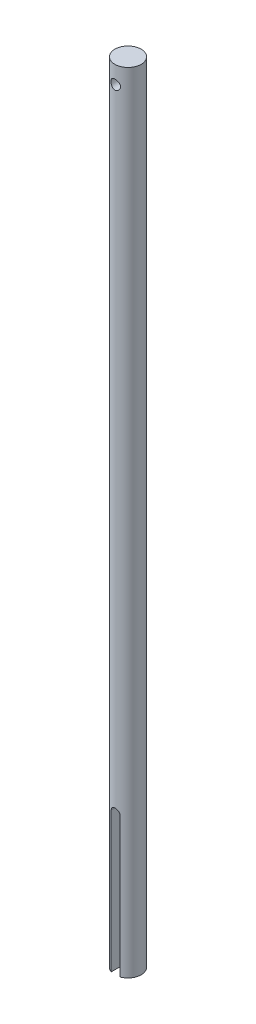
ISO-10303-21;
HEADER;
FILE_DESCRIPTION(('STEP AP214'),'2;1');
FILE_NAME('part.step','',(''),(''),'','','');
FILE_SCHEMA(('AUTOMOTIVE_DESIGN { 1 0 10303 214 1 1 1 1 }'));
ENDSEC;
DATA;
#1=APPLICATION_CONTEXT('core data for automotive mechanical design processes');
#2=APPLICATION_PROTOCOL_DEFINITION('international standard','automotive_design',2000,#1);
#3=PRODUCT_CONTEXT('',#1,'mechanical');
#4=PRODUCT('Part','Part','',(#3));
#5=PRODUCT_RELATED_PRODUCT_CATEGORY('part','',(#4));
#6=PRODUCT_DEFINITION_FORMATION('','',#4);
#7=PRODUCT_DEFINITION_CONTEXT('part definition',#1,'design');
#8=PRODUCT_DEFINITION('design','',#6,#7);
#9=PRODUCT_DEFINITION_SHAPE('','',#8);
#10=(LENGTH_UNIT() NAMED_UNIT(*) SI_UNIT(.MILLI.,.METRE.));
#11=(NAMED_UNIT(*) PLANE_ANGLE_UNIT() SI_UNIT($,.RADIAN.));
#12=(NAMED_UNIT(*) SI_UNIT($,.STERADIAN.) SOLID_ANGLE_UNIT());
#13=UNCERTAINTY_MEASURE_WITH_UNIT(LENGTH_MEASURE(1.E-05),#10,'distance_accuracy_value','');
#14=(GEOMETRIC_REPRESENTATION_CONTEXT(3) GLOBAL_UNCERTAINTY_ASSIGNED_CONTEXT((#13)) GLOBAL_UNIT_ASSIGNED_CONTEXT((#10,
#11,#12)) REPRESENTATION_CONTEXT('',''));
#15=CARTESIAN_POINT('',(0.,0.,0.));
#16=DIRECTION('',(0.,0.,1.));
#17=DIRECTION('',(1.,0.,0.));
#18=AXIS2_PLACEMENT_3D('',#15,#16,#17);
#19=CARTESIAN_POINT('',(0.,0.,0.));
#20=DIRECTION('',(0.,1.,0.));
#21=DIRECTION('',(0.,0.,1.));
#22=AXIS2_PLACEMENT_3D('',#19,#20,#21);
#23=PLANE('',#22);
#24=CARTESIAN_POINT('',(0.,0.,0.));
#25=DIRECTION('',(0.,1.,0.));
#26=DIRECTION('',(0.,0.,1.));
#27=AXIS2_PLACEMENT_3D('',#24,#25,#26);
#28=CIRCLE('',#27,4.7625);
#29=CARTESIAN_POINT('',(-1.58749999999999,0.,-4.49012806053458));
#30=VERTEX_POINT('',#29);
#31=CARTESIAN_POINT('',(-1.58749999999999,0.,4.49012806053458));
#32=VERTEX_POINT('',#31);
#33=EDGE_CURVE('E107',#30,#32,#28,.T.);
#34=ORIENTED_EDGE('',*,*,#33,.F.);
#35=DIRECTION('',(0.,0.,1.));
#36=VECTOR('',#35,1.);
#37=CARTESIAN_POINT('',(-1.58749999999999,0.,0.));
#38=LINE('',#37,#36);
#39=EDGE_CURVE('E114',#30,#32,#38,.T.);
#40=ORIENTED_EDGE('',*,*,#39,.T.);
#41=EDGE_LOOP('',(#34,#40));
#42=FACE_BOUND('',#41,.T.);
#43=ADVANCED_FACE('F35',(#42),#23,.F.);
#44=CARTESIAN_POINT('',(0.,285.75,0.));
#45=DIRECTION('',(0.,-1.,0.));
#46=DIRECTION('',(0.,0.,-1.));
#47=AXIS2_PLACEMENT_3D('',#44,#45,#46);
#48=CYLINDRICAL_SURFACE('',#47,4.7625);
#49=CARTESIAN_POINT('',(0.,281.1272,-4.7625));
#50=CARTESIAN_POINT('',(-0.0937545755041885,281.127202355901,-4.76250171834447));
#51=CARTESIAN_POINT('',(-0.187492537746567,281.119542129238,-4.75970697405948));
#52=CARTESIAN_POINT('',(-0.372179051588622,281.089218213223,-4.74883616948695));
#53=CARTESIAN_POINT('',(-0.463127800957485,281.066555590202,-4.7407604845552));
#54=CARTESIAN_POINT('',(-0.639546381771836,281.007125673839,-4.7201979571911));
#55=CARTESIAN_POINT('',(-0.725026017466991,280.970384495207,-4.7077192853569));
#56=CARTESIAN_POINT('',(-0.88860522192782,280.883968723704,-4.67960297548279));
#57=CARTESIAN_POINT('',(-0.966702948193986,280.834290913451,-4.6639645518196));
#58=CARTESIAN_POINT('',(-1.11643400456062,280.721327149813,-4.63045168616153));
#59=CARTESIAN_POINT('',(-1.18773147100918,280.657614086317,-4.61251683817496));
#60=CARTESIAN_POINT('',(-1.31889594298571,280.519295329149,-4.57674015098026));
#61=CARTESIAN_POINT('',(-1.3787597706873,280.444686617315,-4.55889833896658));
#62=CARTESIAN_POINT('',(-1.48742500324077,280.283492618156,-4.52463700135301));
#63=CARTESIAN_POINT('',(-1.53576368249298,280.196578570947,-4.5082894987665));
#64=CARTESIAN_POINT('',(-1.61698961938085,280.015167151298,-4.47980104480066));
#65=CARTESIAN_POINT('',(-1.64988259520988,279.920672600448,-4.46765853711715));
#66=CARTESIAN_POINT('',(-1.69797749038511,279.730636633904,-4.44959767382086));
#67=CARTESIAN_POINT('',(-1.71381711651929,279.635278542342,-4.44345581754789));
#68=CARTESIAN_POINT('',(-1.72934980765037,279.443075365701,-4.4374352710222));
#69=CARTESIAN_POINT('',(-1.72904899898391,279.346230858767,-4.43755420439544));
#70=CARTESIAN_POINT('',(-1.71279924732252,279.159511344778,-4.44384811377055));
#71=CARTESIAN_POINT('',(-1.69771806001629,279.069547440929,-4.44968724869642));
#72=CARTESIAN_POINT('',(-1.65376436768735,278.893526697569,-4.46620813858151));
#73=CARTESIAN_POINT('',(-1.62488992090507,278.807470410024,-4.4768905753505));
#74=CARTESIAN_POINT('',(-1.55366551460966,278.63987756879,-4.50210772591772));
#75=CARTESIAN_POINT('',(-1.51108084761873,278.558451175084,-4.51670873881532));
#76=CARTESIAN_POINT('',(-1.41380812045639,278.403641349493,-4.54809404564589));
#77=CARTESIAN_POINT('',(-1.35911607826873,278.330260575648,-4.56487905712761));
#78=CARTESIAN_POINT('',(-1.23515054513019,278.188798335844,-4.60002246491734));
#79=CARTESIAN_POINT('',(-1.16517908451574,278.121335224825,-4.61841361301414));
#80=CARTESIAN_POINT('',(-1.01469862225518,277.998923641465,-4.65378991051253));
#81=CARTESIAN_POINT('',(-0.934188206237402,277.943976851583,-4.6707748706975));
#82=CARTESIAN_POINT('',(-0.763420245819729,277.847534071726,-4.70172488258923));
#83=CARTESIAN_POINT('',(-0.673044833285321,277.806231568085,-4.71564563055728));
#84=CARTESIAN_POINT('',(-0.48599928401269,277.739617835782,-4.73857256830597));
#85=CARTESIAN_POINT('',(-0.389331773096026,277.714299982999,-4.74758079364978));
#86=CARTESIAN_POINT('',(-0.197659749704722,277.681534161322,-4.75931617922052));
#87=CARTESIAN_POINT('',(-0.102815493160612,277.673252673865,-4.76233603636104));
#88=CARTESIAN_POINT('',(0.0869438724046454,277.672383788029,-4.76265074022797));
#89=CARTESIAN_POINT('',(0.181858962924007,277.679793173969,-4.75994675999552));
#90=CARTESIAN_POINT('',(0.365545840083653,277.709453508677,-4.74931100003495));
#91=CARTESIAN_POINT('',(0.454416128347589,277.731169052846,-4.74156792972121));
#92=CARTESIAN_POINT('',(0.627198052222043,277.788131307548,-4.72182130283949));
#93=CARTESIAN_POINT('',(0.711109041367521,277.823379777685,-4.70981719224998));
#94=CARTESIAN_POINT('',(0.874274930435845,277.9075089794,-4.68231719842578));
#95=CARTESIAN_POINT('',(0.95332805701118,277.956750729093,-4.66673127727809));
#96=CARTESIAN_POINT('',(1.10230592632144,278.067056141677,-4.63380601545739));
#97=CARTESIAN_POINT('',(1.17222744690549,278.128123958708,-4.61646605967034));
#98=CARTESIAN_POINT('',(1.30491394288274,278.264247587931,-4.58078402533573));
#99=CARTESIAN_POINT('',(1.36708593931879,278.339881999128,-4.5624385518248));
#100=CARTESIAN_POINT('',(1.47795904800677,278.500883869895,-4.52773988544859));
#101=CARTESIAN_POINT('',(1.52665934582227,278.586251917474,-4.51138681306805));
#102=CARTESIAN_POINT('',(1.60915598482924,278.764768583548,-4.48262715523981));
#103=CARTESIAN_POINT('',(1.64292313672782,278.857932020626,-4.47022831205347));
#104=CARTESIAN_POINT('',(1.69408926902747,279.049191964841,-4.4510929570739));
#105=CARTESIAN_POINT('',(1.71149749451732,279.147285652631,-4.44435324730583));
#106=CARTESIAN_POINT('',(1.72865526381664,279.339243723648,-4.4377059010901));
#107=CARTESIAN_POINT('',(1.72940752835192,279.433005869573,-4.43741033254274));
#108=CARTESIAN_POINT('',(1.71577013964867,279.619244395488,-4.4427009187927));
#109=CARTESIAN_POINT('',(1.70138173895319,279.711720881194,-4.44828658705249));
#110=CARTESIAN_POINT('',(1.65863204862724,279.890271962107,-4.46439725812017));
#111=CARTESIAN_POINT('',(1.63065377546419,279.976451530709,-4.47478651136457));
#112=CARTESIAN_POINT('',(1.56184677525983,280.142949695612,-4.49926303354308));
#113=CARTESIAN_POINT('',(1.52101490553977,280.223266852644,-4.51335120671582));
#114=CARTESIAN_POINT('',(1.42529173471966,280.380112352823,-4.54451319020949));
#115=CARTESIAN_POINT('',(1.36980066722248,280.456251794312,-4.56170088396454));
#116=CARTESIAN_POINT('',(1.2472883429977,280.598459822631,-4.59670891849955));
#117=CARTESIAN_POINT('',(1.18026354487465,280.664525304499,-4.6145294522533));
#118=CARTESIAN_POINT('',(1.03263324037727,280.788018397014,-4.64984991483973));
#119=CARTESIAN_POINT('',(0.951521301887577,280.844860009911,-4.66729078291507));
#120=CARTESIAN_POINT('',(0.780291521443958,280.944070184188,-4.69894908939758));
#121=CARTESIAN_POINT('',(0.690173949614117,280.986439179507,-4.71316662444688));
#122=CARTESIAN_POINT('',(0.501900679624105,281.055757574612,-4.73694368902278));
#123=CARTESIAN_POINT('',(0.403639098126046,281.082448295233,-4.7464247096542));
#124=CARTESIAN_POINT('',(0.203577477173889,281.118164502359,-4.75920062737302));
#125=CARTESIAN_POINT('',(0.101778949190978,281.127197442459,-4.7624981345839));
#126=CARTESIAN_POINT('',(0.,281.1272,-4.7625));
#127=B_SPLINE_CURVE_WITH_KNOTS('',3,(#49,#50,#51,#52,#53,#54,#55,#56,#57,#58,#59,#60,#61,#62,
#63,#64,#65,#66,#67,#68,#69,#70,#71,#72,#73,#74,#75,#76,#77,#78,#79,#80,#81,#82,#83,#84,#85,#86,
#87,#88,#89,#90,#91,#92,#93,#94,#95,#96,#97,#98,#99,#100,#101,#102,#103,#104,#105,#106,#107,
#108,#109,#110,#111,#112,#113,#114,#115,#116,#117,#118,#119,#120,#121,#122,#123,#124,#125,#126),
.UNSPECIFIED.,.T.,.F.,(4,2,2,2,2,2,2,2,2,2,2,2,2,2,2,2,2,2,2,2,2,2,2,2,2,2,2,2,2,2,2,2,2,2,2,2,
2,2,4),(0.,0.280888568560694,0.561757174448096,0.842107291718059,1.12252719966264,
1.41308696989153,1.70372738016214,2.00458224645653,2.30532564451792,2.59438406168858,
2.88333276331156,3.15627507377103,3.42925581927924,3.70718323201373,3.98520218895517,
4.28060702184993,4.57605154002559,4.87552186191706,5.1748680001882,5.459182033083,
5.74343780440507,6.01761745219632,6.29183276195998,6.57388985710037,6.85604621068671,
7.15348950144263,7.45095077031253,7.74899093368199,8.04686256106611,8.32674955230255,
8.6066133911253,8.87901088412521,9.15147502956571,9.43753165766332,9.72367627577635,
10.0239198759341,10.3241544729829,10.6292128503899,10.9341424305637),.UNSPECIFIED.);
#128=CARTESIAN_POINT('',(0.,281.1272,-4.7625));
#129=VERTEX_POINT('',#128);
#130=EDGE_CURVE('E11',#129,#129,#127,.T.);
#131=ORIENTED_EDGE('',*,*,#130,.T.);
#132=EDGE_LOOP('',(#131));
#133=FACE_BOUND('',#132,.T.);
#134=CARTESIAN_POINT('',(0.,277.6728,4.7625));
#135=CARTESIAN_POINT('',(-0.0937545755041915,277.672797644099,4.76250171834447));
#136=CARTESIAN_POINT('',(-0.187492537746573,277.680457870762,4.75970697405948));
#137=CARTESIAN_POINT('',(-0.372179051588628,277.710781786777,4.74883616948695));
#138=CARTESIAN_POINT('',(-0.463127800957488,277.733444409798,4.7407604845552));
#139=CARTESIAN_POINT('',(-0.639546381771836,277.792874326161,4.7201979571911));
#140=CARTESIAN_POINT('',(-0.725026017466991,277.829615504793,4.7077192853569));
#141=CARTESIAN_POINT('',(-0.88860522192782,277.916031276296,4.67960297548279));
#142=CARTESIAN_POINT('',(-0.966702948193986,277.965709086549,4.6639645518196));
#143=CARTESIAN_POINT('',(-1.11643400456062,278.078672850187,4.63045168616153));
#144=CARTESIAN_POINT('',(-1.18773147100918,278.142385913683,4.61251683817496));
#145=CARTESIAN_POINT('',(-1.31889594298571,278.280704670851,4.57674015098026));
#146=CARTESIAN_POINT('',(-1.3787597706873,278.355313382684,4.55889833896658));
#147=CARTESIAN_POINT('',(-1.48742500324077,278.516507381844,4.52463700135301));
#148=CARTESIAN_POINT('',(-1.53576368249298,278.603421429053,4.5082894987665));
#149=CARTESIAN_POINT('',(-1.61698961938085,278.784832848702,4.47980104480066));
#150=CARTESIAN_POINT('',(-1.64988259520988,278.879327399552,4.46765853711715));
#151=CARTESIAN_POINT('',(-1.69797749038511,279.069363366096,4.44959767382086));
#152=CARTESIAN_POINT('',(-1.71381711651929,279.164721457658,4.44345581754789));
#153=CARTESIAN_POINT('',(-1.72934980765037,279.356924634299,4.4374352710222));
#154=CARTESIAN_POINT('',(-1.72904899898391,279.453769141233,4.43755420439544));
#155=CARTESIAN_POINT('',(-1.71279924732252,279.640488655222,4.44384811377055));
#156=CARTESIAN_POINT('',(-1.69771806001629,279.730452559071,4.44968724869642));
#157=CARTESIAN_POINT('',(-1.65376436768735,279.906473302431,4.46620813858151));
#158=CARTESIAN_POINT('',(-1.62488992090508,279.992529589976,4.4768905753505));
#159=CARTESIAN_POINT('',(-1.55366551460966,280.16012243121,4.50210772591772));
#160=CARTESIAN_POINT('',(-1.5110808476187,280.241548824916,4.51670873881533));
#161=CARTESIAN_POINT('',(-1.41380812045637,280.396358650507,4.5480940456459));
#162=CARTESIAN_POINT('',(-1.35911607826873,280.469739424352,4.56487905712761));
#163=CARTESIAN_POINT('',(-1.2351505451302,280.611201664156,4.60002246491734));
#164=CARTESIAN_POINT('',(-1.16517908451574,280.678664775175,4.61841361301414));
#165=CARTESIAN_POINT('',(-1.01469862225518,280.801076358535,4.65378991051253));
#166=CARTESIAN_POINT('',(-0.934188206237402,280.856023148417,4.6707748706975));
#167=CARTESIAN_POINT('',(-0.76342024581973,280.952465928274,4.70172488258923));
#168=CARTESIAN_POINT('',(-0.673044833285321,280.993768431915,4.71564563055728));
#169=CARTESIAN_POINT('',(-0.48599928401269,281.060382164218,4.73857256830597));
#170=CARTESIAN_POINT('',(-0.389331773096026,281.085700017001,4.74758079364978));
#171=CARTESIAN_POINT('',(-0.197659749704722,281.118465838678,4.75931617922052));
#172=CARTESIAN_POINT('',(-0.102815493160612,281.126747326135,4.76233603636104));
#173=CARTESIAN_POINT('',(0.0869438724046453,281.127616211971,4.76265074022797));
#174=CARTESIAN_POINT('',(0.181858962924007,281.120206826031,4.75994675999552));
#175=CARTESIAN_POINT('',(0.365545840083653,281.090546491323,4.74931100003495));
#176=CARTESIAN_POINT('',(0.45441612834759,281.068830947154,4.74156792972121));
#177=CARTESIAN_POINT('',(0.627198052222043,281.011868692452,4.72182130283949));
#178=CARTESIAN_POINT('',(0.711109041367519,280.976620222315,4.70981719224998));
#179=CARTESIAN_POINT('',(0.874274930435854,280.8924910206,4.68231719842578));
#180=CARTESIAN_POINT('',(0.9533280570112,280.843249270907,4.66673127727808));
#181=CARTESIAN_POINT('',(1.10230592632146,280.732943858323,4.63380601545739));
#182=CARTESIAN_POINT('',(1.17222744690549,280.671876041292,4.61646605967034));
#183=CARTESIAN_POINT('',(1.30491394288273,280.535752412069,4.58078402533573));
#184=CARTESIAN_POINT('',(1.36708593931879,280.460118000872,4.5624385518248));
#185=CARTESIAN_POINT('',(1.47795904800677,280.299116130105,4.52773988544859));
#186=CARTESIAN_POINT('',(1.52665934582227,280.213748082526,4.51138681306805));
#187=CARTESIAN_POINT('',(1.60915598482924,280.035231416451,4.48262715523981));
#188=CARTESIAN_POINT('',(1.64292313672782,279.942067979374,4.47022831205347));
#189=CARTESIAN_POINT('',(1.69408926902747,279.750808035159,4.4510929570739));
#190=CARTESIAN_POINT('',(1.71149749451732,279.652714347369,4.44435324730583));
#191=CARTESIAN_POINT('',(1.72865526381664,279.460756276352,4.4377059010901));
#192=CARTESIAN_POINT('',(1.72940752835192,279.366994130427,4.43741033254274));
#193=CARTESIAN_POINT('',(1.71577013964868,279.180755604512,4.4427009187927));
#194=CARTESIAN_POINT('',(1.7013817389532,279.088279118806,4.44828658705248));
#195=CARTESIAN_POINT('',(1.65863204862724,278.909728037893,4.46439725812017));
#196=CARTESIAN_POINT('',(1.63065377546417,278.823548469291,4.47478651136457));
#197=CARTESIAN_POINT('',(1.56184677525981,278.657050304388,4.49926303354309));
#198=CARTESIAN_POINT('',(1.52101490553977,278.576733147356,4.51335120671582));
#199=CARTESIAN_POINT('',(1.42529173471966,278.419887647177,4.54451319020949));
#200=CARTESIAN_POINT('',(1.36980066722249,278.343748205688,4.56170088396454));
#201=CARTESIAN_POINT('',(1.2472883429977,278.201540177369,4.59670891849955));
#202=CARTESIAN_POINT('',(1.18026354487465,278.135474695501,4.6145294522533));
#203=CARTESIAN_POINT('',(1.03263324037727,278.011981602985,4.64984991483973));
#204=CARTESIAN_POINT('',(0.951521301887578,277.955139990089,4.66729078291507));
#205=CARTESIAN_POINT('',(0.780291521443957,277.855929815812,4.69894908939758));
#206=CARTESIAN_POINT('',(0.690173949614117,277.813560820493,4.71316662444688));
#207=CARTESIAN_POINT('',(0.501900679624105,277.744242425388,4.73694368902278));
#208=CARTESIAN_POINT('',(0.403639098126046,277.717551704767,4.7464247096542));
#209=CARTESIAN_POINT('',(0.203577477173889,277.681835497641,4.75920062737302));
#210=CARTESIAN_POINT('',(0.101778949190978,277.672802557541,4.7624981345839));
#211=CARTESIAN_POINT('',(0.,277.6728,4.7625));
#212=B_SPLINE_CURVE_WITH_KNOTS('',3,(#134,#135,#136,#137,#138,#139,#140,#141,#142,#143,#144,
#145,#146,#147,#148,#149,#150,#151,#152,#153,#154,#155,#156,#157,#158,#159,#160,#161,#162,#163,
#164,#165,#166,#167,#168,#169,#170,#171,#172,#173,#174,#175,#176,#177,#178,#179,#180,#181,#182,
#183,#184,#185,#186,#187,#188,#189,#190,#191,#192,#193,#194,#195,#196,#197,#198,#199,#200,#201,
#202,#203,#204,#205,#206,#207,#208,#209,#210,#211),.UNSPECIFIED.,.T.,.F.,(4,2,2,2,2,2,2,2,2,2,2,
2,2,2,2,2,2,2,2,2,2,2,2,2,2,2,2,2,2,2,2,2,2,2,2,2,2,2,4),(0.,0.280888568560703,
0.561757174448097,0.842107291718059,1.12252719966264,1.41308696989153,1.70372738016214,
2.00458224645653,2.30532564451792,2.59438406168858,2.88333276331156,3.15627507377103,
3.42925581927924,3.70718323201374,3.98520218895516,4.28060702184992,4.57605154002559,
4.87552186191705,5.1748680001882,5.459182033083,5.74343780440507,6.01761745219632,
6.29183276195997,6.57388985710038,6.8560462106867,7.15348950144263,7.45095077031253,
7.74899093368199,8.04686256106611,8.32674955230255,8.6066133911253,8.87901088412521,
9.1514750295657,9.43753165766331,9.72367627577635,10.0239198759341,10.3241544729828,
10.6292128503899,10.9341424305637),.UNSPECIFIED.);
#213=CARTESIAN_POINT('',(0.,277.6728,4.7625));
#214=VERTEX_POINT('',#213);
#215=EDGE_CURVE('E47',#214,#214,#212,.T.);
#216=ORIENTED_EDGE('',*,*,#215,.T.);
#217=EDGE_LOOP('',(#216));
#218=FACE_BOUND('',#217,.T.);
#219=CARTESIAN_POINT('',(0.,285.75,0.));
#220=DIRECTION('',(0.,1.,0.));
#221=DIRECTION('',(0.,0.,1.));
#222=AXIS2_PLACEMENT_3D('',#219,#220,#221);
#223=CIRCLE('',#222,4.7625);
#224=CARTESIAN_POINT('',(0.,285.75,4.7625));
#225=VERTEX_POINT('',#224);
#226=EDGE_CURVE('E108',#225,#225,#223,.T.);
#227=ORIENTED_EDGE('',*,*,#226,.F.);
#228=EDGE_LOOP('',(#227));
#229=FACE_BOUND('',#228,.T.);
#230=ORIENTED_EDGE('',*,*,#33,.T.);
#231=DIRECTION('',(0.,-1.,0.));
#232=VECTOR('',#231,1.);
#233=CARTESIAN_POINT('',(-1.58750000000003,285.75,4.49012806053457));
#234=LINE('',#233,#232);
#235=CARTESIAN_POINT('',(-1.5875,50.8,4.49012806053458));
#236=VERTEX_POINT('',#235);
#237=EDGE_CURVE('E62',#32,#236,#234,.F.);
#238=ORIENTED_EDGE('',*,*,#237,.T.);
#239=CARTESIAN_POINT('',(-1.58750000000002,50.8,4.49012806053457));
#240=CARTESIAN_POINT('',(-1.58750118659149,50.8433236636718,4.49012376824762));
#241=CARTESIAN_POINT('',(-1.5857253727825,50.8866252112256,4.49075587659901));
#242=CARTESIAN_POINT('',(-1.5786506511703,50.9728923771872,4.49324932071638));
#243=CARTESIAN_POINT('',(-1.57335269440074,51.0158580831098,4.49511032466043));
#244=CARTESIAN_POINT('',(-1.55227444692889,51.1435225273223,4.50245308906633));
#245=CARTESIAN_POINT('',(-1.53130921993215,51.2273245934544,4.5096952684298));
#246=CARTESIAN_POINT('',(-1.47630897878082,51.3899549930045,4.52799568584438));
#247=CARTESIAN_POINT('',(-1.44228117688023,51.4687860431608,4.53905181775275));
#248=CARTESIAN_POINT('',(-1.36219125098175,51.6196894864837,4.56372574710893));
#249=CARTESIAN_POINT('',(-1.31612173723111,51.6917576923944,4.57734511612121));
#250=CARTESIAN_POINT('',(-1.2113440872178,51.8298433672277,4.6062023763825));
#251=CARTESIAN_POINT('',(-1.15224715626125,51.8955573727344,4.6214804345719));
#252=CARTESIAN_POINT('',(-1.02391915324899,52.0163520532443,4.65159484800102));
#253=CARTESIAN_POINT('',(-0.954686280480342,52.0714308347938,4.66643112419066));
#254=CARTESIAN_POINT('',(-0.805820787955586,52.1707737361017,4.69445789253335));
#255=CARTESIAN_POINT('',(-0.72596389185663,52.2147180627386,4.70759532129443));
#256=CARTESIAN_POINT('',(-0.559481434320818,52.2884276995535,4.73026753659895));
#257=CARTESIAN_POINT('',(-0.47285795000457,52.3181973411399,4.73980342349379));
#258=CARTESIAN_POINT('',(-0.298496585946398,52.3616804651701,4.7539127543939));
#259=CARTESIAN_POINT('',(-0.210902287205443,52.375916445179,4.7586472801936));
#260=CARTESIAN_POINT('',(-0.0344471140108966,52.3895896239094,4.76319228341059));
#261=CARTESIAN_POINT('',(0.0544134536020447,52.3890303488407,4.76300393411567));
#262=CARTESIAN_POINT('',(0.227177354381018,52.3734597005682,4.75783336333485));
#263=CARTESIAN_POINT('',(0.311138415418021,52.3590160622394,4.75303946823631));
#264=CARTESIAN_POINT('',(0.475367452197924,52.3170257971048,4.73943299795058));
#265=CARTESIAN_POINT('',(0.55563522289112,52.2894784437476,4.73062019993148));
#266=CARTESIAN_POINT('',(0.711442289061635,52.221731075759,4.70972623380696));
#267=CARTESIAN_POINT('',(0.786905502725692,52.1813694033683,4.69760360068322));
#268=CARTESIAN_POINT('',(0.930155285192242,52.0892723271673,4.6713519044207));
#269=CARTESIAN_POINT('',(0.997939758172043,52.0375338294637,4.6572222958618));
#270=CARTESIAN_POINT('',(1.12727952679153,51.92129720813,4.62766206709099));
#271=CARTESIAN_POINT('',(1.18839235843514,51.8563136995196,4.61220151154364));
#272=CARTESIAN_POINT('',(1.29900683940234,51.7168741350756,4.58227891125652));
#273=CARTESIAN_POINT('',(1.34850473755428,51.6424150309349,4.56781719016259));
#274=CARTESIAN_POINT('',(1.43510527937853,51.4847202168642,4.54136174809905));
#275=CARTESIAN_POINT('',(1.47201415259343,51.401371170044,4.52940761230323));
#276=CARTESIAN_POINT('',(1.531080616238,51.229185423076,4.50978741585988));
#277=CARTESIAN_POINT('',(1.55326149223786,51.1403576292717,4.50211458936777));
#278=CARTESIAN_POINT('',(1.57425732309579,51.0088854141626,4.49479260575369));
#279=CARTESIAN_POINT('',(1.57922128474248,50.9672567936064,4.49304834965181));
#280=CARTESIAN_POINT('',(1.585840453013,50.8837595505403,4.49071529419597));
#281=CARTESIAN_POINT('',(1.58749992918951,50.8418913079108,4.49012500388127));
#282=CARTESIAN_POINT('',(1.58749999999998,50.8,4.49012806053458));
#283=B_SPLINE_CURVE_WITH_KNOTS('',3,(#239,#240,#241,#242,#243,#244,#245,#246,#247,#248,#249,
#250,#251,#252,#253,#254,#255,#256,#257,#258,#259,#260,#261,#262,#263,#264,#265,#266,#267,#268,
#269,#270,#271,#272,#273,#274,#275,#276,#277,#278,#279,#280,#281,#282),.UNSPECIFIED.,.F.,.F.,(4,
2,2,2,2,2,2,2,2,2,2,2,2,2,2,2,2,2,2,2,2,4),(0.,0.129886844517501,0.259738631794015,
0.518447652452653,0.777014036783905,1.03573947210231,1.30359951628251,1.57150720533699,
1.84640748531298,2.1212237090479,2.38648034779752,2.65167376748644,2.90646514314354,
3.16127064766843,3.41942767386223,3.6776549920967,3.94801810817154,4.21846842120672,
4.49291122510763,4.76691908385357,4.89267333840742,5.01826500677377),.UNSPECIFIED.);
#284=CARTESIAN_POINT('',(1.58749999999998,50.8,4.49012806053458));
#285=VERTEX_POINT('',#284);
#286=EDGE_CURVE('E90',#236,#285,#283,.T.);
#287=ORIENTED_EDGE('',*,*,#286,.T.);
#288=DIRECTION('',(0.,-1.,0.));
#289=VECTOR('',#288,1.);
#290=CARTESIAN_POINT('',(1.58749999999997,285.75,4.49012806053459));
#291=LINE('',#290,#289);
#292=CARTESIAN_POINT('',(1.5875,0.,4.49012806053458));
#293=VERTEX_POINT('',#292);
#294=EDGE_CURVE('E94',#285,#293,#291,.T.);
#295=ORIENTED_EDGE('',*,*,#294,.T.);
#296=CARTESIAN_POINT('',(1.5875,0.,-4.49012806053458));
#297=VERTEX_POINT('',#296);
#298=EDGE_CURVE('E99',#293,#297,#28,.T.);
#299=ORIENTED_EDGE('',*,*,#298,.T.);
#300=DIRECTION('',(0.,-1.,0.));
#301=VECTOR('',#300,1.);
#302=CARTESIAN_POINT('',(1.58749999999997,285.75,-4.49012806053459));
#303=LINE('',#302,#301);
#304=CARTESIAN_POINT('',(1.58749999999998,50.8,-4.49012806053459));
#305=VERTEX_POINT('',#304);
#306=EDGE_CURVE('E54',#297,#305,#303,.F.);
#307=ORIENTED_EDGE('',*,*,#306,.T.);
#308=CARTESIAN_POINT('',(1.58749999999998,50.8,-4.49012806053459));
#309=CARTESIAN_POINT('',(1.58750118659146,50.8433236636718,-4.49012376824764));
#310=CARTESIAN_POINT('',(1.58572537278246,50.8866252112256,-4.49075587659902));
#311=CARTESIAN_POINT('',(1.57865065117027,50.9728923771872,-4.49324932071639));
#312=CARTESIAN_POINT('',(1.5733526944007,51.0158580831098,-4.49511032466044));
#313=CARTESIAN_POINT('',(1.55227444692886,51.1435225273223,-4.50245308906634));
#314=CARTESIAN_POINT('',(1.53130921993211,51.2273245934544,-4.50969526842981));
#315=CARTESIAN_POINT('',(1.47630897878078,51.3899549930045,-4.52799568584439));
#316=CARTESIAN_POINT('',(1.44228117688019,51.4687860431608,-4.53905181775276));
#317=CARTESIAN_POINT('',(1.36219125098171,51.6196894864837,-4.56372574710894));
#318=CARTESIAN_POINT('',(1.31612173723107,51.6917576923944,-4.57734511612122));
#319=CARTESIAN_POINT('',(1.21134408721776,51.8298433672277,-4.60620237638251));
#320=CARTESIAN_POINT('',(1.15224715626121,51.8955573727344,-4.62148043457191));
#321=CARTESIAN_POINT('',(1.02391915324896,52.0163520532443,-4.65159484800103));
#322=CARTESIAN_POINT('',(0.954686280480305,52.0714308347938,-4.66643112419067));
#323=CARTESIAN_POINT('',(0.805820787955548,52.1707737361017,-4.69445789253336));
#324=CARTESIAN_POINT('',(0.725963891856592,52.2147180627386,-4.70759532129443));
#325=CARTESIAN_POINT('',(0.559481434320779,52.2884276995535,-4.73026753659895));
#326=CARTESIAN_POINT('',(0.472857950004531,52.3181973411399,-4.73980342349379));
#327=CARTESIAN_POINT('',(0.29849658594636,52.3616804651701,-4.7539127543939));
#328=CARTESIAN_POINT('',(0.210902287205405,52.375916445179,-4.7586472801936));
#329=CARTESIAN_POINT('',(0.0344471140108587,52.3895896239094,-4.76319228341059));
#330=CARTESIAN_POINT('',(-0.0544134536020825,52.3890303488407,-4.76300393411567));
#331=CARTESIAN_POINT('',(-0.227177354381056,52.3734597005682,-4.75783336333484));
#332=CARTESIAN_POINT('',(-0.311138415418059,52.3590160622394,-4.75303946823631));
#333=CARTESIAN_POINT('',(-0.475367452197961,52.3170257971048,-4.73943299795057));
#334=CARTESIAN_POINT('',(-0.555635222891157,52.2894784437476,-4.73062019993148));
#335=CARTESIAN_POINT('',(-0.711442289061671,52.221731075759,-4.70972623380695));
#336=CARTESIAN_POINT('',(-0.786905502725729,52.1813694033683,-4.69760360068321));
#337=CARTESIAN_POINT('',(-0.930155285192278,52.0892723271673,-4.6713519044207));
#338=CARTESIAN_POINT('',(-0.997939758172079,52.0375338294637,-4.65722229586179));
#339=CARTESIAN_POINT('',(-1.12727952679157,51.92129720813,-4.62766206709099));
#340=CARTESIAN_POINT('',(-1.18839235843517,51.8563136995196,-4.61220151154363));
#341=CARTESIAN_POINT('',(-1.29900683940237,51.7168741350756,-4.58227891125651));
#342=CARTESIAN_POINT('',(-1.34850473755432,51.6424150309349,-4.56781719016258));
#343=CARTESIAN_POINT('',(-1.43510527937856,51.4847202168642,-4.54136174809904));
#344=CARTESIAN_POINT('',(-1.47201415259347,51.401371170044,-4.52940761230322));
#345=CARTESIAN_POINT('',(-1.53108061623804,51.2291854230759,-4.50978741585986));
#346=CARTESIAN_POINT('',(-1.5532614922379,51.1403576292717,-4.50211458936775));
#347=CARTESIAN_POINT('',(-1.57425732309583,51.0088854141626,-4.49479260575367));
#348=CARTESIAN_POINT('',(-1.57922128474251,50.9672567936064,-4.4930483496518));
#349=CARTESIAN_POINT('',(-1.58584045301304,50.8837595505403,-4.49071529419595));
#350=CARTESIAN_POINT('',(-1.58749992918954,50.8418913079108,-4.49012500388125));
#351=CARTESIAN_POINT('',(-1.58750000000002,50.8,-4.49012806053457));
#352=B_SPLINE_CURVE_WITH_KNOTS('',3,(#308,#309,#310,#311,#312,#313,#314,#315,#316,#317,#318,
#319,#320,#321,#322,#323,#324,#325,#326,#327,#328,#329,#330,#331,#332,#333,#334,#335,#336,#337,
#338,#339,#340,#341,#342,#343,#344,#345,#346,#347,#348,#349,#350,#351),.UNSPECIFIED.,.F.,.F.,(4,
2,2,2,2,2,2,2,2,2,2,2,2,2,2,2,2,2,2,2,2,4),(0.,0.129886844517501,0.259738631794015,
0.518447652452653,0.777014036783904,1.03573947210231,1.3035995162825,1.57150720533699,
1.84640748531298,2.12122370904789,2.38648034779752,2.65167376748644,2.90646514314354,
3.16127064766843,3.41942767386223,3.67765499209669,3.94801810817153,4.21846842120672,
4.49291122510764,4.76691908385357,4.89267333840742,5.01826500677376),.UNSPECIFIED.);
#353=CARTESIAN_POINT('',(-1.5875,50.8,-4.49012806053458));
#354=VERTEX_POINT('',#353);
#355=EDGE_CURVE('E83',#305,#354,#352,.T.);
#356=ORIENTED_EDGE('',*,*,#355,.T.);
#357=DIRECTION('',(0.,-1.,0.));
#358=VECTOR('',#357,1.);
#359=CARTESIAN_POINT('',(-1.58750000000003,285.75,-4.49012806053457));
#360=LINE('',#359,#358);
#361=EDGE_CURVE('E105',#354,#30,#360,.T.);
#362=ORIENTED_EDGE('',*,*,#361,.T.);
#363=EDGE_LOOP('',(#230,#238,#287,#295,#299,#307,#356,#362));
#364=FACE_BOUND('',#363,.T.);
#365=ADVANCED_FACE('F37',(#133,#218,#229,#364),#48,.T.);
#366=CARTESIAN_POINT('',(0.,285.75,0.));
#367=DIRECTION('',(0.,1.,0.));
#368=DIRECTION('',(0.,0.,1.));
#369=AXIS2_PLACEMENT_3D('',#366,#367,#368);
#370=PLANE('',#369);
#371=ORIENTED_EDGE('',*,*,#226,.T.);
#372=EDGE_LOOP('',(#371));
#373=FACE_BOUND('',#372,.T.);
#374=ADVANCED_FACE('F133',(#373),#370,.T.);
#375=ORIENTED_EDGE('',*,*,#298,.F.);
#376=DIRECTION('',(0.,0.,-1.));
#377=VECTOR('',#376,1.);
#378=CARTESIAN_POINT('',(1.5875,0.,0.));
#379=LINE('',#378,#377);
#380=EDGE_CURVE('E111',#293,#297,#379,.T.);
#381=ORIENTED_EDGE('',*,*,#380,.T.);
#382=EDGE_LOOP('',(#375,#381));
#383=FACE_BOUND('',#382,.T.);
#384=ADVANCED_FACE('F128',(#383),#23,.F.);
#385=CARTESIAN_POINT('',(0.,50.8,-4.7625));
#386=DIRECTION('',(0.,0.,1.));
#387=DIRECTION('',(1.,0.,0.));
#388=AXIS2_PLACEMENT_3D('',#385,#386,#387);
#389=CYLINDRICAL_SURFACE('',#388,1.5875);
#390=DIRECTION('',(0.,0.,1.));
#391=VECTOR('',#390,1.);
#392=CARTESIAN_POINT('',(-1.5875,50.8,-4.7625));
#393=LINE('',#392,#391);
#394=EDGE_CURVE('E87',#354,#236,#393,.T.);
#395=ORIENTED_EDGE('',*,*,#394,.F.);
#396=ORIENTED_EDGE('',*,*,#355,.F.);
#397=DIRECTION('',(0.,0.,1.));
#398=VECTOR('',#397,1.);
#399=CARTESIAN_POINT('',(1.58749999999998,50.8,-4.7625));
#400=LINE('',#399,#398);
#401=EDGE_CURVE('E85',#305,#285,#400,.T.);
#402=ORIENTED_EDGE('',*,*,#401,.T.);
#403=ORIENTED_EDGE('',*,*,#286,.F.);
#404=EDGE_LOOP('',(#395,#396,#402,#403));
#405=FACE_BOUND('',#404,.T.);
#406=ADVANCED_FACE('F84',(#405),#389,.F.);
#407=CARTESIAN_POINT('',(-1.58749999999999,-50.8,-4.7625));
#408=DIRECTION('',(-1.,0.,0.));
#409=DIRECTION('',(0.,-1.,0.));
#410=AXIS2_PLACEMENT_3D('',#407,#408,#409);
#411=PLANE('',#410);
#412=ORIENTED_EDGE('',*,*,#394,.T.);
#413=ORIENTED_EDGE('',*,*,#237,.F.);
#414=ORIENTED_EDGE('',*,*,#39,.F.);
#415=ORIENTED_EDGE('',*,*,#361,.F.);
#416=EDGE_LOOP('',(#412,#413,#414,#415));
#417=FACE_BOUND('',#416,.T.);
#418=ADVANCED_FACE('F127',(#417),#411,.F.);
#419=CARTESIAN_POINT('',(1.58750000000001,-50.8,-4.7625));
#420=DIRECTION('',(1.,0.,0.));
#421=DIRECTION('',(0.,1.,0.));
#422=AXIS2_PLACEMENT_3D('',#419,#420,#421);
#423=PLANE('',#422);
#424=ORIENTED_EDGE('',*,*,#401,.F.);
#425=ORIENTED_EDGE('',*,*,#306,.F.);
#426=ORIENTED_EDGE('',*,*,#380,.F.);
#427=ORIENTED_EDGE('',*,*,#294,.F.);
#428=EDGE_LOOP('',(#424,#425,#426,#427));
#429=FACE_BOUND('',#428,.T.);
#430=ADVANCED_FACE('F92',(#429),#423,.F.);
#431=CARTESIAN_POINT('',(0.,279.4,-4.7625));
#432=DIRECTION('',(0.,0.,-1.));
#433=DIRECTION('',(-1.,0.,0.));
#434=AXIS2_PLACEMENT_3D('',#431,#432,#433);
#435=CYLINDRICAL_SURFACE('',#434,1.72719999999999);
#436=ORIENTED_EDGE('',*,*,#215,.F.);
#437=EDGE_LOOP('',(#436));
#438=FACE_BOUND('',#437,.T.);
#439=ORIENTED_EDGE('',*,*,#130,.F.);
#440=EDGE_LOOP('',(#439));
#441=FACE_BOUND('',#440,.T.);
#442=ADVANCED_FACE('F132',(#438,#441),#435,.F.);
#443=CLOSED_SHELL('',(#43,#365,#374,#384,#406,#418,#430,#442));
#444=MANIFOLD_SOLID_BREP('B2',#443);
#445=ADVANCED_BREP_SHAPE_REPRESENTATION('',(#18,#444),#14);
#446=SHAPE_DEFINITION_REPRESENTATION(#9,#445);
ENDSEC;
END-ISO-10303-21;
